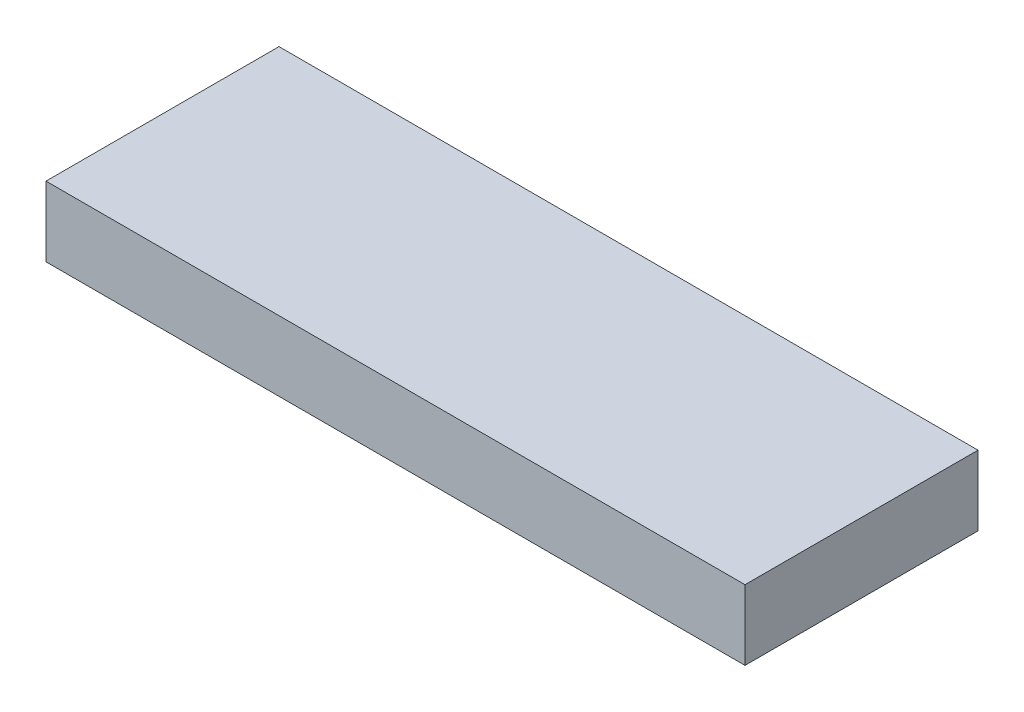
ISO-10303-21;
HEADER;
FILE_DESCRIPTION(('STEP AP214'),'2;1');
FILE_NAME('part.step','',(''),(''),'','','');
FILE_SCHEMA(('AUTOMOTIVE_DESIGN { 1 0 10303 214 1 1 1 1 }'));
ENDSEC;
DATA;
#1=APPLICATION_CONTEXT('core data for automotive mechanical design processes');
#2=APPLICATION_PROTOCOL_DEFINITION('international standard','automotive_design',2000,#1);
#3=PRODUCT_CONTEXT('',#1,'mechanical');
#4=PRODUCT('Part','Part','',(#3));
#5=PRODUCT_RELATED_PRODUCT_CATEGORY('part','',(#4));
#6=PRODUCT_DEFINITION_FORMATION('','',#4);
#7=PRODUCT_DEFINITION_CONTEXT('part definition',#1,'design');
#8=PRODUCT_DEFINITION('design','',#6,#7);
#9=PRODUCT_DEFINITION_SHAPE('','',#8);
#10=(LENGTH_UNIT() NAMED_UNIT(*) SI_UNIT(.MILLI.,.METRE.));
#11=(NAMED_UNIT(*) PLANE_ANGLE_UNIT() SI_UNIT($,.RADIAN.));
#12=(NAMED_UNIT(*) SI_UNIT($,.STERADIAN.) SOLID_ANGLE_UNIT());
#13=UNCERTAINTY_MEASURE_WITH_UNIT(LENGTH_MEASURE(1.E-05),#10,'distance_accuracy_value','');
#14=(GEOMETRIC_REPRESENTATION_CONTEXT(3) GLOBAL_UNCERTAINTY_ASSIGNED_CONTEXT((#13)) GLOBAL_UNIT_ASSIGNED_CONTEXT((#10,
#11,#12)) REPRESENTATION_CONTEXT('',''));
#15=CARTESIAN_POINT('',(0.,0.,0.));
#16=DIRECTION('',(0.,0.,1.));
#17=DIRECTION('',(1.,0.,0.));
#18=AXIS2_PLACEMENT_3D('',#15,#16,#17);
#19=CARTESIAN_POINT('',(300.,46.99,40.));
#20=DIRECTION('',(0.,0.,-1.));
#21=DIRECTION('',(-1.,0.,0.));
#22=AXIS2_PLACEMENT_3D('',#19,#20,#21);
#23=PLANE('',#22);
#24=DIRECTION('',(0.,-1.,0.));
#25=VECTOR('',#24,1.);
#26=CARTESIAN_POINT('',(300.,1.71683972880179E-13,40.));
#27=LINE('',#26,#25);
#28=CARTESIAN_POINT('',(300.,50.,40.));
#29=VERTEX_POINT('',#28);
#30=CARTESIAN_POINT('',(300.,47.,40.));
#31=VERTEX_POINT('',#30);
#32=EDGE_CURVE('E81',#29,#31,#27,.T.);
#33=ORIENTED_EDGE('',*,*,#32,.T.);
#34=DIRECTION('',(-1.,0.,0.));
#35=VECTOR('',#34,1.);
#36=CARTESIAN_POINT('',(300.,47.,40.));
#37=LINE('',#36,#35);
#38=CARTESIAN_POINT('',(270.,47.,40.));
#39=VERTEX_POINT('',#38);
#40=EDGE_CURVE('E85',#31,#39,#37,.T.);
#41=ORIENTED_EDGE('',*,*,#40,.T.);
#42=DIRECTION('',(0.,1.,0.));
#43=VECTOR('',#42,1.);
#44=CARTESIAN_POINT('',(270.,46.99,40.));
#45=LINE('',#44,#43);
#46=CARTESIAN_POINT('',(270.,50.,40.));
#47=VERTEX_POINT('',#46);
#48=EDGE_CURVE('E44',#39,#47,#45,.T.);
#49=ORIENTED_EDGE('',*,*,#48,.T.);
#50=DIRECTION('',(1.,0.,0.));
#51=VECTOR('',#50,1.);
#52=CARTESIAN_POINT('',(-300.,50.,40.));
#53=LINE('',#52,#51);
#54=EDGE_CURVE('E99',#47,#29,#53,.T.);
#55=ORIENTED_EDGE('',*,*,#54,.T.);
#56=EDGE_LOOP('',(#33,#41,#49,#55));
#57=FACE_BOUND('',#56,.T.);
#58=ADVANCED_FACE('F35',(#57),#23,.T.);
#59=CARTESIAN_POINT('',(300.,46.99,50.));
#60=DIRECTION('',(0.,0.,1.));
#61=DIRECTION('',(1.,0.,0.));
#62=AXIS2_PLACEMENT_3D('',#59,#60,#61);
#63=PLANE('',#62);
#64=DIRECTION('',(0.,1.,0.));
#65=VECTOR('',#64,1.);
#66=CARTESIAN_POINT('',(270.,46.99,50.));
#67=LINE('',#66,#65);
#68=CARTESIAN_POINT('',(270.,47.,50.));
#69=VERTEX_POINT('',#68);
#70=CARTESIAN_POINT('',(270.,50.,50.));
#71=VERTEX_POINT('',#70);
#72=EDGE_CURVE('E11',#69,#71,#67,.T.);
#73=ORIENTED_EDGE('',*,*,#72,.F.);
#74=DIRECTION('',(1.,0.,0.));
#75=VECTOR('',#74,1.);
#76=CARTESIAN_POINT('',(300.,47.,50.));
#77=LINE('',#76,#75);
#78=CARTESIAN_POINT('',(300.,47.,50.));
#79=VERTEX_POINT('',#78);
#80=EDGE_CURVE('E96',#69,#79,#77,.T.);
#81=ORIENTED_EDGE('',*,*,#80,.T.);
#82=DIRECTION('',(0.,1.,0.));
#83=VECTOR('',#82,1.);
#84=CARTESIAN_POINT('',(300.,1.71683972880179E-13,50.));
#85=LINE('',#84,#83);
#86=CARTESIAN_POINT('',(300.,50.,50.));
#87=VERTEX_POINT('',#86);
#88=EDGE_CURVE('E39',#79,#87,#85,.T.);
#89=ORIENTED_EDGE('',*,*,#88,.T.);
#90=DIRECTION('',(-1.,0.,0.));
#91=VECTOR('',#90,1.);
#92=CARTESIAN_POINT('',(-300.,50.,50.));
#93=LINE('',#92,#91);
#94=EDGE_CURVE('E88',#87,#71,#93,.T.);
#95=ORIENTED_EDGE('',*,*,#94,.T.);
#96=EDGE_LOOP('',(#73,#81,#89,#95));
#97=FACE_BOUND('',#96,.T.);
#98=ADVANCED_FACE('F94',(#97),#63,.T.);
#99=CARTESIAN_POINT('',(270.,46.99,40.));
#100=DIRECTION('',(-1.,0.,0.));
#101=DIRECTION('',(0.,0.,1.));
#102=AXIS2_PLACEMENT_3D('',#99,#100,#101);
#103=PLANE('',#102);
#104=ORIENTED_EDGE('',*,*,#48,.F.);
#105=DIRECTION('',(0.,0.,1.));
#106=VECTOR('',#105,1.);
#107=CARTESIAN_POINT('',(270.,47.,3.));
#108=LINE('',#107,#106);
#109=EDGE_CURVE('E102',#39,#69,#108,.T.);
#110=ORIENTED_EDGE('',*,*,#109,.T.);
#111=ORIENTED_EDGE('',*,*,#72,.T.);
#112=DIRECTION('',(0.,0.,-1.));
#113=VECTOR('',#112,1.);
#114=CARTESIAN_POINT('',(270.,50.,60.));
#115=LINE('',#114,#113);
#116=EDGE_CURVE('E90',#71,#47,#115,.T.);
#117=ORIENTED_EDGE('',*,*,#116,.T.);
#118=EDGE_LOOP('',(#104,#110,#111,#117));
#119=FACE_BOUND('',#118,.T.);
#120=ADVANCED_FACE('F111',(#119),#103,.T.);
#121=CARTESIAN_POINT('',(300.,1.71683972880179E-13,0.));
#122=DIRECTION('',(-1.,0.,0.));
#123=DIRECTION('',(0.,-1.,0.));
#124=AXIS2_PLACEMENT_3D('',#121,#122,#123);
#125=PLANE('',#124);
#126=ORIENTED_EDGE('',*,*,#32,.F.);
#127=DIRECTION('',(0.,0.,-1.));
#128=VECTOR('',#127,1.);
#129=CARTESIAN_POINT('',(300.,50.,60.));
#130=LINE('',#129,#128);
#131=EDGE_CURVE('E76',#87,#29,#130,.T.);
#132=ORIENTED_EDGE('',*,*,#131,.F.);
#133=ORIENTED_EDGE('',*,*,#88,.F.);
#134=DIRECTION('',(0.,0.,1.));
#135=VECTOR('',#134,1.);
#136=CARTESIAN_POINT('',(300.,47.,3.));
#137=LINE('',#136,#135);
#138=EDGE_CURVE('E84',#31,#79,#137,.T.);
#139=ORIENTED_EDGE('',*,*,#138,.F.);
#140=EDGE_LOOP('',(#126,#132,#133,#139));
#141=FACE_BOUND('',#140,.T.);
#142=ADVANCED_FACE('F78',(#141),#125,.F.);
#143=CARTESIAN_POINT('',(-300.,50.,60.));
#144=DIRECTION('',(0.,-1.,0.));
#145=DIRECTION('',(0.,0.,-1.));
#146=AXIS2_PLACEMENT_3D('',#143,#144,#145);
#147=PLANE('',#146);
#148=ORIENTED_EDGE('',*,*,#54,.F.);
#149=ORIENTED_EDGE('',*,*,#116,.F.);
#150=ORIENTED_EDGE('',*,*,#94,.F.);
#151=ORIENTED_EDGE('',*,*,#131,.T.);
#152=EDGE_LOOP('',(#148,#149,#150,#151));
#153=FACE_BOUND('',#152,.T.);
#154=ADVANCED_FACE('F89',(#153),#147,.F.);
#155=CARTESIAN_POINT('',(300.,47.,3.));
#156=DIRECTION('',(0.,1.,0.));
#157=DIRECTION('',(0.,0.,1.));
#158=AXIS2_PLACEMENT_3D('',#155,#156,#157);
#159=PLANE('',#158);
#160=ORIENTED_EDGE('',*,*,#40,.F.);
#161=ORIENTED_EDGE('',*,*,#138,.T.);
#162=ORIENTED_EDGE('',*,*,#80,.F.);
#163=ORIENTED_EDGE('',*,*,#109,.F.);
#164=EDGE_LOOP('',(#160,#161,#162,#163));
#165=FACE_BOUND('',#164,.T.);
#166=ADVANCED_FACE('F37',(#165),#159,.F.);
#167=CLOSED_SHELL('',(#58,#98,#120,#142,#154,#166));
#168=MANIFOLD_SOLID_BREP('B2',#167);
#169=ADVANCED_BREP_SHAPE_REPRESENTATION('',(#18,#168),#14);
#170=SHAPE_DEFINITION_REPRESENTATION(#9,#169);
ENDSEC;
END-ISO-10303-21;
